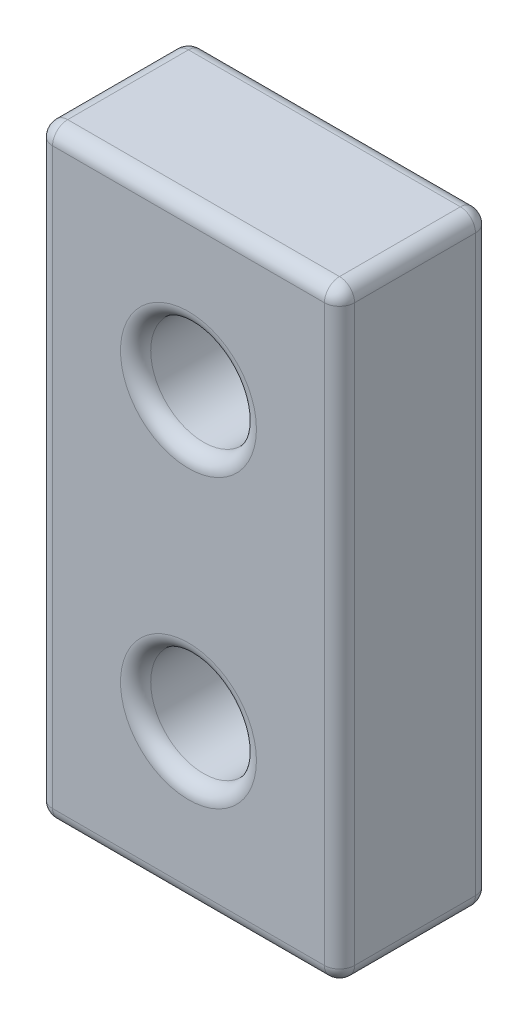
ISO-10303-21;
HEADER;
FILE_DESCRIPTION(('STEP AP214'),'2;1');
FILE_NAME('part.step','',(''),(''),'','','');
FILE_SCHEMA(('AUTOMOTIVE_DESIGN { 1 0 10303 214 1 1 1 1 }'));
ENDSEC;
DATA;
#1=APPLICATION_CONTEXT('core data for automotive mechanical design processes');
#2=APPLICATION_PROTOCOL_DEFINITION('international standard','automotive_design',2000,#1);
#3=PRODUCT_CONTEXT('',#1,'mechanical');
#4=PRODUCT('Part','Part','',(#3));
#5=PRODUCT_RELATED_PRODUCT_CATEGORY('part','',(#4));
#6=PRODUCT_DEFINITION_FORMATION('','',#4);
#7=PRODUCT_DEFINITION_CONTEXT('part definition',#1,'design');
#8=PRODUCT_DEFINITION('design','',#6,#7);
#9=PRODUCT_DEFINITION_SHAPE('','',#8);
#10=(LENGTH_UNIT() NAMED_UNIT(*) SI_UNIT(.MILLI.,.METRE.));
#11=(NAMED_UNIT(*) PLANE_ANGLE_UNIT() SI_UNIT($,.RADIAN.));
#12=(NAMED_UNIT(*) SI_UNIT($,.STERADIAN.) SOLID_ANGLE_UNIT());
#13=UNCERTAINTY_MEASURE_WITH_UNIT(LENGTH_MEASURE(1.E-05),#10,'distance_accuracy_value','');
#14=(GEOMETRIC_REPRESENTATION_CONTEXT(3) GLOBAL_UNCERTAINTY_ASSIGNED_CONTEXT((#13)) GLOBAL_UNIT_ASSIGNED_CONTEXT((#10,
#11,#12)) REPRESENTATION_CONTEXT('',''));
#15=CARTESIAN_POINT('',(0.,0.,0.));
#16=DIRECTION('',(0.,0.,1.));
#17=DIRECTION('',(1.,0.,0.));
#18=AXIS2_PLACEMENT_3D('',#15,#16,#17);
#19=CARTESIAN_POINT('',(9.,-19.,10.));
#20=DIRECTION('',(0.,0.,-1.));
#21=DIRECTION('',(-1.,0.,0.));
#22=AXIS2_PLACEMENT_3D('',#19,#20,#21);
#23=CYLINDRICAL_SURFACE('',#22,1.);
#24=DIRECTION('',(0.,0.,-1.));
#25=VECTOR('',#24,1.);
#26=CARTESIAN_POINT('',(10.,-19.,10.));
#27=LINE('',#26,#25);
#28=CARTESIAN_POINT('',(10.,-19.,9.));
#29=VERTEX_POINT('',#28);
#30=CARTESIAN_POINT('',(10.,-19.,0.999999999999999));
#31=VERTEX_POINT('',#30);
#32=EDGE_CURVE('E298',#29,#31,#27,.T.);
#33=ORIENTED_EDGE('',*,*,#32,.F.);
#34=CARTESIAN_POINT('',(9.,-19.,9.));
#35=DIRECTION('',(0.,0.,-1.));
#36=DIRECTION('',(-1.,0.,0.));
#37=AXIS2_PLACEMENT_3D('',#34,#35,#36);
#38=CIRCLE('',#37,1.);
#39=CARTESIAN_POINT('',(8.99999999999999,-20.,9.));
#40=VERTEX_POINT('',#39);
#41=EDGE_CURVE('E142',#29,#40,#38,.T.);
#42=ORIENTED_EDGE('',*,*,#41,.T.);
#43=DIRECTION('',(0.,0.,-1.));
#44=VECTOR('',#43,1.);
#45=CARTESIAN_POINT('',(8.99999999999999,-20.,10.));
#46=LINE('',#45,#44);
#47=CARTESIAN_POINT('',(8.99999999999999,-20.,0.999999999999999));
#48=VERTEX_POINT('',#47);
#49=EDGE_CURVE('E270',#40,#48,#46,.T.);
#50=ORIENTED_EDGE('',*,*,#49,.T.);
#51=CARTESIAN_POINT('',(9.,-19.,0.999999999999999));
#52=DIRECTION('',(0.,0.,-1.));
#53=DIRECTION('',(-1.,0.,0.));
#54=AXIS2_PLACEMENT_3D('',#51,#52,#53);
#55=CIRCLE('',#54,1.);
#56=EDGE_CURVE('E194',#48,#31,#55,.F.);
#57=ORIENTED_EDGE('',*,*,#56,.T.);
#58=EDGE_LOOP('',(#33,#42,#50,#57));
#59=FACE_BOUND('',#58,.T.);
#60=ADVANCED_FACE('F35',(#59),#23,.T.);
#61=CARTESIAN_POINT('',(10.,-19.,10.));
#62=DIRECTION('',(-1.,0.,0.));
#63=DIRECTION('',(0.,0.,1.));
#64=AXIS2_PLACEMENT_3D('',#61,#62,#63);
#65=PLANE('',#64);
#66=DIRECTION('',(0.,0.,-1.));
#67=VECTOR('',#66,1.);
#68=CARTESIAN_POINT('',(10.,19.,10.));
#69=LINE('',#68,#67);
#70=CARTESIAN_POINT('',(10.,19.,9.));
#71=VERTEX_POINT('',#70);
#72=CARTESIAN_POINT('',(10.,19.,0.999999999999999));
#73=VERTEX_POINT('',#72);
#74=EDGE_CURVE('E295',#71,#73,#69,.T.);
#75=ORIENTED_EDGE('',*,*,#74,.F.);
#76=DIRECTION('',(0.,1.,0.));
#77=VECTOR('',#76,1.);
#78=CARTESIAN_POINT('',(10.,-19.,9.));
#79=LINE('',#78,#77);
#80=EDGE_CURVE('E192',#71,#29,#79,.F.);
#81=ORIENTED_EDGE('',*,*,#80,.T.);
#82=ORIENTED_EDGE('',*,*,#32,.T.);
#83=DIRECTION('',(0.,1.,0.));
#84=VECTOR('',#83,1.);
#85=CARTESIAN_POINT('',(10.,-19.,0.999999999999999));
#86=LINE('',#85,#84);
#87=EDGE_CURVE('E189',#31,#73,#86,.T.);
#88=ORIENTED_EDGE('',*,*,#87,.T.);
#89=EDGE_LOOP('',(#75,#81,#82,#88));
#90=FACE_BOUND('',#89,.T.);
#91=ADVANCED_FACE('F344',(#90),#65,.F.);
#92=CARTESIAN_POINT('',(9.,19.,10.));
#93=DIRECTION('',(0.,0.,-1.));
#94=DIRECTION('',(-1.,0.,0.));
#95=AXIS2_PLACEMENT_3D('',#92,#93,#94);
#96=CYLINDRICAL_SURFACE('',#95,1.);
#97=DIRECTION('',(0.,0.,-1.));
#98=VECTOR('',#97,1.);
#99=CARTESIAN_POINT('',(8.99999999999999,20.,10.));
#100=LINE('',#99,#98);
#101=CARTESIAN_POINT('',(8.99999999999999,20.,9.));
#102=VERTEX_POINT('',#101);
#103=CARTESIAN_POINT('',(8.99999999999999,20.,0.999999999999999));
#104=VERTEX_POINT('',#103);
#105=EDGE_CURVE('E292',#102,#104,#100,.T.);
#106=ORIENTED_EDGE('',*,*,#105,.F.);
#107=CARTESIAN_POINT('',(9.,19.,9.));
#108=DIRECTION('',(0.,0.,-1.));
#109=DIRECTION('',(-1.,0.,0.));
#110=AXIS2_PLACEMENT_3D('',#107,#108,#109);
#111=CIRCLE('',#110,1.);
#112=EDGE_CURVE('E187',#102,#71,#111,.T.);
#113=ORIENTED_EDGE('',*,*,#112,.T.);
#114=ORIENTED_EDGE('',*,*,#74,.T.);
#115=CARTESIAN_POINT('',(9.,19.,0.999999999999999));
#116=DIRECTION('',(0.,0.,-1.));
#117=DIRECTION('',(-1.,0.,0.));
#118=AXIS2_PLACEMENT_3D('',#115,#116,#117);
#119=CIRCLE('',#118,1.);
#120=EDGE_CURVE('E185',#73,#104,#119,.F.);
#121=ORIENTED_EDGE('',*,*,#120,.T.);
#122=EDGE_LOOP('',(#106,#113,#114,#121));
#123=FACE_BOUND('',#122,.T.);
#124=ADVANCED_FACE('F345',(#123),#96,.T.);
#125=CARTESIAN_POINT('',(-8.99999999999999,20.,10.));
#126=DIRECTION('',(0.,-1.,0.));
#127=DIRECTION('',(0.,0.,-1.));
#128=AXIS2_PLACEMENT_3D('',#125,#126,#127);
#129=PLANE('',#128);
#130=DIRECTION('',(0.,0.,-1.));
#131=VECTOR('',#130,1.);
#132=CARTESIAN_POINT('',(-8.99999999999999,20.,10.));
#133=LINE('',#132,#131);
#134=CARTESIAN_POINT('',(-8.99999999999999,20.,9.));
#135=VERTEX_POINT('',#134);
#136=CARTESIAN_POINT('',(-8.99999999999999,20.,0.999999999999999));
#137=VERTEX_POINT('',#136);
#138=EDGE_CURVE('E289',#135,#137,#133,.T.);
#139=ORIENTED_EDGE('',*,*,#138,.F.);
#140=DIRECTION('',(-1.,0.,0.));
#141=VECTOR('',#140,1.);
#142=CARTESIAN_POINT('',(8.99999999999999,20.,9.));
#143=LINE('',#142,#141);
#144=EDGE_CURVE('E183',#135,#102,#143,.F.);
#145=ORIENTED_EDGE('',*,*,#144,.T.);
#146=ORIENTED_EDGE('',*,*,#105,.T.);
#147=DIRECTION('',(-1.,0.,0.));
#148=VECTOR('',#147,1.);
#149=CARTESIAN_POINT('',(-8.99999999999999,20.,0.999999999999999));
#150=LINE('',#149,#148);
#151=EDGE_CURVE('E181',#104,#137,#150,.T.);
#152=ORIENTED_EDGE('',*,*,#151,.T.);
#153=EDGE_LOOP('',(#139,#145,#146,#152));
#154=FACE_BOUND('',#153,.T.);
#155=ADVANCED_FACE('F602',(#154),#129,.F.);
#156=CARTESIAN_POINT('',(-9.,19.,10.));
#157=DIRECTION('',(0.,0.,-1.));
#158=DIRECTION('',(-1.,0.,0.));
#159=AXIS2_PLACEMENT_3D('',#156,#157,#158);
#160=CYLINDRICAL_SURFACE('',#159,1.);
#161=DIRECTION('',(0.,0.,-1.));
#162=VECTOR('',#161,1.);
#163=CARTESIAN_POINT('',(-10.,19.,10.));
#164=LINE('',#163,#162);
#165=CARTESIAN_POINT('',(-10.,19.,9.));
#166=VERTEX_POINT('',#165);
#167=CARTESIAN_POINT('',(-10.,19.,0.999999999999999));
#168=VERTEX_POINT('',#167);
#169=EDGE_CURVE('E286',#166,#168,#164,.T.);
#170=ORIENTED_EDGE('',*,*,#169,.F.);
#171=CARTESIAN_POINT('',(-9.,19.,9.));
#172=DIRECTION('',(0.,0.,-1.));
#173=DIRECTION('',(-1.,0.,0.));
#174=AXIS2_PLACEMENT_3D('',#171,#172,#173);
#175=CIRCLE('',#174,1.);
#176=EDGE_CURVE('E179',#166,#135,#175,.T.);
#177=ORIENTED_EDGE('',*,*,#176,.T.);
#178=ORIENTED_EDGE('',*,*,#138,.T.);
#179=CARTESIAN_POINT('',(-9.,19.,0.999999999999999));
#180=DIRECTION('',(0.,0.,-1.));
#181=DIRECTION('',(-1.,0.,0.));
#182=AXIS2_PLACEMENT_3D('',#179,#180,#181);
#183=CIRCLE('',#182,1.);
#184=EDGE_CURVE('E177',#137,#168,#183,.F.);
#185=ORIENTED_EDGE('',*,*,#184,.T.);
#186=EDGE_LOOP('',(#170,#177,#178,#185));
#187=FACE_BOUND('',#186,.T.);
#188=ADVANCED_FACE('F594',(#187),#160,.T.);
#189=CARTESIAN_POINT('',(-10.,-19.,10.));
#190=DIRECTION('',(1.,0.,0.));
#191=DIRECTION('',(0.,0.,-1.));
#192=AXIS2_PLACEMENT_3D('',#189,#190,#191);
#193=PLANE('',#192);
#194=DIRECTION('',(0.,0.,-1.));
#195=VECTOR('',#194,1.);
#196=CARTESIAN_POINT('',(-10.,-19.,10.));
#197=LINE('',#196,#195);
#198=CARTESIAN_POINT('',(-10.,-19.,9.));
#199=VERTEX_POINT('',#198);
#200=CARTESIAN_POINT('',(-10.,-19.,0.999999999999999));
#201=VERTEX_POINT('',#200);
#202=EDGE_CURVE('E278',#199,#201,#197,.T.);
#203=ORIENTED_EDGE('',*,*,#202,.F.);
#204=DIRECTION('',(0.,-1.,0.));
#205=VECTOR('',#204,1.);
#206=CARTESIAN_POINT('',(-10.,19.,9.));
#207=LINE('',#206,#205);
#208=EDGE_CURVE('E175',#199,#166,#207,.F.);
#209=ORIENTED_EDGE('',*,*,#208,.T.);
#210=ORIENTED_EDGE('',*,*,#169,.T.);
#211=DIRECTION('',(0.,-1.,0.));
#212=VECTOR('',#211,1.);
#213=CARTESIAN_POINT('',(-10.,-19.,0.999999999999999));
#214=LINE('',#213,#212);
#215=EDGE_CURVE('E173',#168,#201,#214,.T.);
#216=ORIENTED_EDGE('',*,*,#215,.T.);
#217=EDGE_LOOP('',(#203,#209,#210,#216));
#218=FACE_BOUND('',#217,.T.);
#219=ADVANCED_FACE('F324',(#218),#193,.F.);
#220=CARTESIAN_POINT('',(-9.,-19.,10.));
#221=DIRECTION('',(0.,0.,-1.));
#222=DIRECTION('',(-1.,0.,0.));
#223=AXIS2_PLACEMENT_3D('',#220,#221,#222);
#224=CYLINDRICAL_SURFACE('',#223,1.);
#225=DIRECTION('',(0.,0.,-1.));
#226=VECTOR('',#225,1.);
#227=CARTESIAN_POINT('',(-8.99999999999999,-20.,10.));
#228=LINE('',#227,#226);
#229=CARTESIAN_POINT('',(-8.99999999999999,-20.,9.));
#230=VERTEX_POINT('',#229);
#231=CARTESIAN_POINT('',(-8.99999999999999,-20.,0.999999999999999));
#232=VERTEX_POINT('',#231);
#233=EDGE_CURVE('E272',#230,#232,#228,.T.);
#234=ORIENTED_EDGE('',*,*,#233,.F.);
#235=CARTESIAN_POINT('',(-9.,-19.,9.));
#236=DIRECTION('',(0.,0.,-1.));
#237=DIRECTION('',(-1.,0.,0.));
#238=AXIS2_PLACEMENT_3D('',#235,#236,#237);
#239=CIRCLE('',#238,1.);
#240=EDGE_CURVE('E171',#230,#199,#239,.T.);
#241=ORIENTED_EDGE('',*,*,#240,.T.);
#242=ORIENTED_EDGE('',*,*,#202,.T.);
#243=CARTESIAN_POINT('',(-9.,-19.,0.999999999999999));
#244=DIRECTION('',(0.,0.,-1.));
#245=DIRECTION('',(-1.,0.,0.));
#246=AXIS2_PLACEMENT_3D('',#243,#244,#245);
#247=CIRCLE('',#246,1.);
#248=EDGE_CURVE('E169',#201,#232,#247,.F.);
#249=ORIENTED_EDGE('',*,*,#248,.T.);
#250=EDGE_LOOP('',(#234,#241,#242,#249));
#251=FACE_BOUND('',#250,.T.);
#252=ADVANCED_FACE('F322',(#251),#224,.T.);
#253=CARTESIAN_POINT('',(-8.99999999999999,-20.,10.));
#254=DIRECTION('',(0.,1.,0.));
#255=DIRECTION('',(0.,0.,1.));
#256=AXIS2_PLACEMENT_3D('',#253,#254,#255);
#257=PLANE('',#256);
#258=ORIENTED_EDGE('',*,*,#49,.F.);
#259=DIRECTION('',(1.,0.,0.));
#260=VECTOR('',#259,1.);
#261=CARTESIAN_POINT('',(-8.99999999999999,-20.,9.));
#262=LINE('',#261,#260);
#263=EDGE_CURVE('E133',#40,#230,#262,.F.);
#264=ORIENTED_EDGE('',*,*,#263,.T.);
#265=ORIENTED_EDGE('',*,*,#233,.T.);
#266=DIRECTION('',(1.,0.,0.));
#267=VECTOR('',#266,1.);
#268=CARTESIAN_POINT('',(-8.99999999999999,-20.,0.999999999999999));
#269=LINE('',#268,#267);
#270=EDGE_CURVE('E162',#232,#48,#269,.T.);
#271=ORIENTED_EDGE('',*,*,#270,.T.);
#272=EDGE_LOOP('',(#258,#264,#265,#271));
#273=FACE_BOUND('',#272,.T.);
#274=ADVANCED_FACE('F269',(#273),#257,.F.);
#275=CARTESIAN_POINT('',(9.,-19.,10.));
#276=DIRECTION('',(0.,0.,1.));
#277=DIRECTION('',(1.,0.,0.));
#278=AXIS2_PLACEMENT_3D('',#275,#276,#277);
#279=PLANE('',#278);
#280=DIRECTION('',(0.,-1.,0.));
#281=VECTOR('',#280,1.);
#282=CARTESIAN_POINT('',(-9.,-19.,10.));
#283=LINE('',#282,#281);
#284=CARTESIAN_POINT('',(-9.,19.,10.));
#285=VERTEX_POINT('',#284);
#286=CARTESIAN_POINT('',(-9.,-19.,10.));
#287=VERTEX_POINT('',#286);
#288=EDGE_CURVE('E160',#285,#287,#283,.T.);
#289=ORIENTED_EDGE('',*,*,#288,.T.);
#290=DIRECTION('',(1.,0.,0.));
#291=VECTOR('',#290,1.);
#292=CARTESIAN_POINT('',(8.99999999999999,-19.,10.));
#293=LINE('',#292,#291);
#294=CARTESIAN_POINT('',(9.,-19.,10.));
#295=VERTEX_POINT('',#294);
#296=EDGE_CURVE('E131',#287,#295,#293,.T.);
#297=ORIENTED_EDGE('',*,*,#296,.T.);
#298=DIRECTION('',(0.,1.,0.));
#299=VECTOR('',#298,1.);
#300=CARTESIAN_POINT('',(9.,19.,10.));
#301=LINE('',#300,#299);
#302=CARTESIAN_POINT('',(9.,19.,10.));
#303=VERTEX_POINT('',#302);
#304=EDGE_CURVE('E148',#295,#303,#301,.T.);
#305=ORIENTED_EDGE('',*,*,#304,.T.);
#306=DIRECTION('',(-1.,0.,0.));
#307=VECTOR('',#306,1.);
#308=CARTESIAN_POINT('',(-8.99999999999999,19.,10.));
#309=LINE('',#308,#307);
#310=EDGE_CURVE('E154',#303,#285,#309,.T.);
#311=ORIENTED_EDGE('',*,*,#310,.T.);
#312=EDGE_LOOP('',(#289,#297,#305,#311));
#313=FACE_BOUND('',#312,.T.);
#314=CARTESIAN_POINT('',(0.,-9.5,10.));
#315=DIRECTION('',(0.,0.,1.));
#316=DIRECTION('',(1.,0.,0.));
#317=AXIS2_PLACEMENT_3D('',#314,#315,#316);
#318=CIRCLE('',#317,4.5);
#319=CARTESIAN_POINT('',(4.5,-9.5,10.));
#320=VERTEX_POINT('',#319);
#321=EDGE_CURVE('E155',#320,#320,#318,.F.);
#322=ORIENTED_EDGE('',*,*,#321,.T.);
#323=EDGE_LOOP('',(#322));
#324=FACE_BOUND('',#323,.T.);
#325=CARTESIAN_POINT('',(0.,9.5,10.));
#326=DIRECTION('',(0.,0.,1.));
#327=DIRECTION('',(1.,0.,0.));
#328=AXIS2_PLACEMENT_3D('',#325,#326,#327);
#329=CIRCLE('',#328,4.5);
#330=CARTESIAN_POINT('',(4.49999999999999,9.5,10.));
#331=VERTEX_POINT('',#330);
#332=EDGE_CURVE('E300',#331,#331,#329,.F.);
#333=ORIENTED_EDGE('',*,*,#332,.T.);
#334=EDGE_LOOP('',(#333));
#335=FACE_BOUND('',#334,.T.);
#336=ADVANCED_FACE('F157',(#313,#324,#335),#279,.T.);
#337=CARTESIAN_POINT('',(9.,-19.,0.));
#338=DIRECTION('',(0.,0.,1.));
#339=DIRECTION('',(1.,0.,0.));
#340=AXIS2_PLACEMENT_3D('',#337,#338,#339);
#341=PLANE('',#340);
#342=DIRECTION('',(-1.,0.,0.));
#343=VECTOR('',#342,1.);
#344=CARTESIAN_POINT('',(9.,19.,0.));
#345=LINE('',#344,#343);
#346=CARTESIAN_POINT('',(-9.,19.,0.));
#347=VERTEX_POINT('',#346);
#348=CARTESIAN_POINT('',(9.,19.,0.));
#349=VERTEX_POINT('',#348);
#350=EDGE_CURVE('E52',#347,#349,#345,.F.);
#351=ORIENTED_EDGE('',*,*,#350,.T.);
#352=DIRECTION('',(0.,1.,0.));
#353=VECTOR('',#352,1.);
#354=CARTESIAN_POINT('',(9.,-19.,0.));
#355=LINE('',#354,#353);
#356=CARTESIAN_POINT('',(8.99999999999999,-19.,0.));
#357=VERTEX_POINT('',#356);
#358=EDGE_CURVE('E213',#349,#357,#355,.F.);
#359=ORIENTED_EDGE('',*,*,#358,.T.);
#360=DIRECTION('',(1.,0.,0.));
#361=VECTOR('',#360,1.);
#362=CARTESIAN_POINT('',(9.,-19.,0.));
#363=LINE('',#362,#361);
#364=CARTESIAN_POINT('',(-9.,-19.,0.));
#365=VERTEX_POINT('',#364);
#366=EDGE_CURVE('E209',#357,#365,#363,.F.);
#367=ORIENTED_EDGE('',*,*,#366,.T.);
#368=DIRECTION('',(0.,-1.,0.));
#369=VECTOR('',#368,1.);
#370=CARTESIAN_POINT('',(-9.,-19.,0.));
#371=LINE('',#370,#369);
#372=EDGE_CURVE('E57',#365,#347,#371,.F.);
#373=ORIENTED_EDGE('',*,*,#372,.T.);
#374=EDGE_LOOP('',(#351,#359,#367,#373));
#375=FACE_BOUND('',#374,.T.);
#376=CARTESIAN_POINT('',(0.,-9.5,0.));
#377=DIRECTION('',(0.,0.,1.));
#378=DIRECTION('',(1.,0.,0.));
#379=AXIS2_PLACEMENT_3D('',#376,#377,#378);
#380=CIRCLE('',#379,4.4392135623731);
#381=CARTESIAN_POINT('',(4.4392135623731,-9.5,0.));
#382=VERTEX_POINT('',#381);
#383=EDGE_CURVE('E206',#382,#382,#380,.T.);
#384=ORIENTED_EDGE('',*,*,#383,.T.);
#385=EDGE_LOOP('',(#384));
#386=FACE_BOUND('',#385,.T.);
#387=CARTESIAN_POINT('',(0.,9.5,0.));
#388=DIRECTION('',(0.,0.,1.));
#389=DIRECTION('',(1.,0.,0.));
#390=AXIS2_PLACEMENT_3D('',#387,#388,#389);
#391=CIRCLE('',#390,4.4392135623731);
#392=CARTESIAN_POINT('',(4.43921356237309,9.5,0.));
#393=VERTEX_POINT('',#392);
#394=EDGE_CURVE('E203',#393,#393,#391,.T.);
#395=ORIENTED_EDGE('',*,*,#394,.T.);
#396=EDGE_LOOP('',(#395));
#397=FACE_BOUND('',#396,.T.);
#398=ADVANCED_FACE('F556',(#375,#386,#397),#341,.F.);
#399=CARTESIAN_POINT('',(0.,-9.5,0.));
#400=DIRECTION('',(0.,0.,-1.));
#401=DIRECTION('',(-1.,0.,0.));
#402=AXIS2_PLACEMENT_3D('',#399,#400,#401);
#403=CYLINDRICAL_SURFACE('',#402,3.5);
#404=CARTESIAN_POINT('',(0.,-9.5,9.));
#405=DIRECTION('',(0.,0.,1.));
#406=DIRECTION('',(1.,0.,0.));
#407=AXIS2_PLACEMENT_3D('',#404,#405,#406);
#408=CIRCLE('',#407,3.5);
#409=CARTESIAN_POINT('',(3.5,-9.5,9.));
#410=VERTEX_POINT('',#409);
#411=EDGE_CURVE('E197',#410,#410,#408,.T.);
#412=ORIENTED_EDGE('',*,*,#411,.T.);
#413=EDGE_LOOP('',(#412));
#414=FACE_BOUND('',#413,.T.);
#415=CARTESIAN_POINT('',(0.,-9.5,0.525000000000001));
#416=DIRECTION('',(0.,0.,-1.));
#417=DIRECTION('',(-1.,0.,0.));
#418=AXIS2_PLACEMENT_3D('',#415,#416,#417);
#419=CIRCLE('',#418,3.5);
#420=CARTESIAN_POINT('',(-3.5,-9.5,0.525000000000001));
#421=VERTEX_POINT('',#420);
#422=EDGE_CURVE('E276',#421,#421,#419,.T.);
#423=ORIENTED_EDGE('',*,*,#422,.T.);
#424=EDGE_LOOP('',(#423));
#425=FACE_BOUND('',#424,.T.);
#426=ADVANCED_FACE('F547',(#414,#425),#403,.F.);
#427=CARTESIAN_POINT('',(0.,-9.5,0.));
#428=DIRECTION('',(0.,0.,-1.));
#429=DIRECTION('',(-1.,0.,0.));
#430=AXIS2_PLACEMENT_3D('',#427,#428,#429);
#431=CONICAL_SURFACE('',#430,4.025,0.78539816339745);
#432=CARTESIAN_POINT('',(0.,-9.5,0.292893218813452));
#433=DIRECTION('',(0.,0.,1.));
#434=DIRECTION('',(1.,0.,0.));
#435=AXIS2_PLACEMENT_3D('',#432,#433,#434);
#436=CIRCLE('',#435,3.73210678118655);
#437=CARTESIAN_POINT('',(3.73210678118655,-9.5,0.292893218813452));
#438=VERTEX_POINT('',#437);
#439=EDGE_CURVE('E44',#438,#438,#436,.F.);
#440=ORIENTED_EDGE('',*,*,#439,.T.);
#441=EDGE_LOOP('',(#440));
#442=FACE_BOUND('',#441,.T.);
#443=ORIENTED_EDGE('',*,*,#422,.F.);
#444=EDGE_LOOP('',(#443));
#445=FACE_BOUND('',#444,.T.);
#446=ADVANCED_FACE('F537',(#442,#445),#431,.F.);
#447=CARTESIAN_POINT('',(0.,9.5,0.));
#448=DIRECTION('',(0.,0.,-1.));
#449=DIRECTION('',(-1.,0.,0.));
#450=AXIS2_PLACEMENT_3D('',#447,#448,#449);
#451=CYLINDRICAL_SURFACE('',#450,3.5);
#452=CARTESIAN_POINT('',(0.,9.5,9.));
#453=DIRECTION('',(0.,0.,1.));
#454=DIRECTION('',(1.,0.,0.));
#455=AXIS2_PLACEMENT_3D('',#452,#453,#454);
#456=CIRCLE('',#455,3.5);
#457=CARTESIAN_POINT('',(3.49999999999999,9.5,9.));
#458=VERTEX_POINT('',#457);
#459=EDGE_CURVE('E200',#458,#458,#456,.T.);
#460=ORIENTED_EDGE('',*,*,#459,.T.);
#461=EDGE_LOOP('',(#460));
#462=FACE_BOUND('',#461,.T.);
#463=CARTESIAN_POINT('',(0.,9.5,0.525000000000001));
#464=DIRECTION('',(0.,0.,-1.));
#465=DIRECTION('',(-1.,0.,0.));
#466=AXIS2_PLACEMENT_3D('',#463,#464,#465);
#467=CIRCLE('',#466,3.5);
#468=CARTESIAN_POINT('',(-3.5,9.5,0.525000000000001));
#469=VERTEX_POINT('',#468);
#470=EDGE_CURVE('E230',#469,#469,#467,.T.);
#471=ORIENTED_EDGE('',*,*,#470,.T.);
#472=EDGE_LOOP('',(#471));
#473=FACE_BOUND('',#472,.T.);
#474=ADVANCED_FACE('F528',(#462,#473),#451,.F.);
#475=CARTESIAN_POINT('',(0.,9.5,0.));
#476=DIRECTION('',(0.,0.,-1.));
#477=DIRECTION('',(-1.,0.,0.));
#478=AXIS2_PLACEMENT_3D('',#475,#476,#477);
#479=CONICAL_SURFACE('',#478,4.025,0.78539816339745);
#480=CARTESIAN_POINT('',(0.,9.5,0.292893218813452));
#481=DIRECTION('',(0.,0.,1.));
#482=DIRECTION('',(1.,0.,0.));
#483=AXIS2_PLACEMENT_3D('',#480,#481,#482);
#484=CIRCLE('',#483,3.73210678118655);
#485=CARTESIAN_POINT('',(3.73210678118654,9.5,0.292893218813452));
#486=VERTEX_POINT('',#485);
#487=EDGE_CURVE('E11',#486,#486,#484,.F.);
#488=ORIENTED_EDGE('',*,*,#487,.T.);
#489=EDGE_LOOP('',(#488));
#490=FACE_BOUND('',#489,.T.);
#491=ORIENTED_EDGE('',*,*,#470,.F.);
#492=EDGE_LOOP('',(#491));
#493=FACE_BOUND('',#492,.T.);
#494=ADVANCED_FACE('F520',(#490,#493),#479,.F.);
#495=CARTESIAN_POINT('',(9.,19.,9.));
#496=DIRECTION('',(1.,0.,0.));
#497=DIRECTION('',(0.,0.,-1.));
#498=AXIS2_PLACEMENT_3D('',#495,#496,#497);
#499=CYLINDRICAL_SURFACE('',#498,1.);
#500=CARTESIAN_POINT('',(8.99999999999999,19.,9.));
#501=DIRECTION('',(1.,0.,0.));
#502=DIRECTION('',(0.,0.,-1.));
#503=AXIS2_PLACEMENT_3D('',#500,#501,#502);
#504=CIRCLE('',#503,1.);
#505=EDGE_CURVE('E224',#102,#303,#504,.T.);
#506=ORIENTED_EDGE('',*,*,#505,.F.);
#507=ORIENTED_EDGE('',*,*,#144,.F.);
#508=CARTESIAN_POINT('',(-9.,19.,9.));
#509=DIRECTION('',(-1.,0.,0.));
#510=DIRECTION('',(0.,-1.,0.));
#511=AXIS2_PLACEMENT_3D('',#508,#509,#510);
#512=CIRCLE('',#511,1.);
#513=EDGE_CURVE('E227',#285,#135,#512,.T.);
#514=ORIENTED_EDGE('',*,*,#513,.F.);
#515=ORIENTED_EDGE('',*,*,#310,.F.);
#516=EDGE_LOOP('',(#506,#507,#514,#515));
#517=FACE_BOUND('',#516,.T.);
#518=ADVANCED_FACE('F309',(#517),#499,.T.);
#519=CARTESIAN_POINT('',(-9.,19.,9.));
#520=DIRECTION('',(0.,0.,1.));
#521=DIRECTION('',(1.,0.,0.));
#522=AXIS2_PLACEMENT_3D('',#519,#520,#521);
#523=SPHERICAL_SURFACE('',#522,1.);
#524=ORIENTED_EDGE('',*,*,#513,.T.);
#525=ORIENTED_EDGE('',*,*,#176,.F.);
#526=CARTESIAN_POINT('',(-9.,19.,9.));
#527=DIRECTION('',(0.,-1.,0.));
#528=DIRECTION('',(1.,0.,0.));
#529=AXIS2_PLACEMENT_3D('',#526,#527,#528);
#530=CIRCLE('',#529,1.);
#531=EDGE_CURVE('E221',#285,#166,#530,.T.);
#532=ORIENTED_EDGE('',*,*,#531,.F.);
#533=EDGE_LOOP('',(#524,#525,#532));
#534=FACE_BOUND('',#533,.T.);
#535=ADVANCED_FACE('F312',(#534),#523,.T.);
#536=CARTESIAN_POINT('',(9.,19.,9.));
#537=DIRECTION('',(0.,0.,1.));
#538=DIRECTION('',(1.,0.,0.));
#539=AXIS2_PLACEMENT_3D('',#536,#537,#538);
#540=SPHERICAL_SURFACE('',#539,1.);
#541=ORIENTED_EDGE('',*,*,#112,.F.);
#542=ORIENTED_EDGE('',*,*,#505,.T.);
#543=CARTESIAN_POINT('',(9.,19.,9.));
#544=DIRECTION('',(0.,-1.,0.));
#545=DIRECTION('',(1.,0.,0.));
#546=AXIS2_PLACEMENT_3D('',#543,#544,#545);
#547=CIRCLE('',#546,1.);
#548=EDGE_CURVE('E151',#71,#303,#547,.T.);
#549=ORIENTED_EDGE('',*,*,#548,.F.);
#550=EDGE_LOOP('',(#541,#542,#549));
#551=FACE_BOUND('',#550,.T.);
#552=ADVANCED_FACE('F348',(#551),#540,.T.);
#553=CARTESIAN_POINT('',(-9.,-19.,9.));
#554=DIRECTION('',(0.,1.,0.));
#555=DIRECTION('',(0.,0.,1.));
#556=AXIS2_PLACEMENT_3D('',#553,#554,#555);
#557=CYLINDRICAL_SURFACE('',#556,1.);
#558=ORIENTED_EDGE('',*,*,#531,.T.);
#559=ORIENTED_EDGE('',*,*,#208,.F.);
#560=CARTESIAN_POINT('',(-9.,-19.,9.));
#561=DIRECTION('',(0.,-1.,0.));
#562=DIRECTION('',(0.,0.,-1.));
#563=AXIS2_PLACEMENT_3D('',#560,#561,#562);
#564=CIRCLE('',#563,1.);
#565=EDGE_CURVE('E145',#287,#199,#564,.T.);
#566=ORIENTED_EDGE('',*,*,#565,.F.);
#567=ORIENTED_EDGE('',*,*,#288,.F.);
#568=EDGE_LOOP('',(#558,#559,#566,#567));
#569=FACE_BOUND('',#568,.T.);
#570=ADVANCED_FACE('F315',(#569),#557,.T.);
#571=CARTESIAN_POINT('',(9.,-19.,9.));
#572=DIRECTION('',(0.,-1.,0.));
#573=DIRECTION('',(0.,0.,-1.));
#574=AXIS2_PLACEMENT_3D('',#571,#572,#573);
#575=CYLINDRICAL_SURFACE('',#574,1.);
#576=ORIENTED_EDGE('',*,*,#548,.T.);
#577=ORIENTED_EDGE('',*,*,#304,.F.);
#578=CARTESIAN_POINT('',(9.,-19.,9.));
#579=DIRECTION('',(0.,-1.,0.));
#580=DIRECTION('',(0.,0.,-1.));
#581=AXIS2_PLACEMENT_3D('',#578,#579,#580);
#582=CIRCLE('',#581,1.);
#583=EDGE_CURVE('E139',#29,#295,#582,.T.);
#584=ORIENTED_EDGE('',*,*,#583,.F.);
#585=ORIENTED_EDGE('',*,*,#80,.F.);
#586=EDGE_LOOP('',(#576,#577,#584,#585));
#587=FACE_BOUND('',#586,.T.);
#588=ADVANCED_FACE('F149',(#587),#575,.T.);
#589=CARTESIAN_POINT('',(-9.,-19.,9.));
#590=DIRECTION('',(0.,0.,1.));
#591=DIRECTION('',(1.,0.,0.));
#592=AXIS2_PLACEMENT_3D('',#589,#590,#591);
#593=SPHERICAL_SURFACE('',#592,1.);
#594=ORIENTED_EDGE('',*,*,#565,.T.);
#595=ORIENTED_EDGE('',*,*,#240,.F.);
#596=CARTESIAN_POINT('',(-9.,-19.,9.));
#597=DIRECTION('',(1.,0.,0.));
#598=DIRECTION('',(0.,1.,0.));
#599=AXIS2_PLACEMENT_3D('',#596,#597,#598);
#600=CIRCLE('',#599,1.);
#601=EDGE_CURVE('E136',#287,#230,#600,.T.);
#602=ORIENTED_EDGE('',*,*,#601,.F.);
#603=EDGE_LOOP('',(#594,#595,#602));
#604=FACE_BOUND('',#603,.T.);
#605=ADVANCED_FACE('F319',(#604),#593,.T.);
#606=CARTESIAN_POINT('',(9.,-19.,9.));
#607=DIRECTION('',(0.,0.,1.));
#608=DIRECTION('',(1.,0.,0.));
#609=AXIS2_PLACEMENT_3D('',#606,#607,#608);
#610=SPHERICAL_SURFACE('',#609,1.);
#611=ORIENTED_EDGE('',*,*,#41,.F.);
#612=ORIENTED_EDGE('',*,*,#583,.T.);
#613=CARTESIAN_POINT('',(9.,-19.,9.));
#614=DIRECTION('',(-1.,0.,0.));
#615=DIRECTION('',(0.,-1.,0.));
#616=AXIS2_PLACEMENT_3D('',#613,#614,#615);
#617=CIRCLE('',#616,1.);
#618=EDGE_CURVE('E127',#40,#295,#617,.T.);
#619=ORIENTED_EDGE('',*,*,#618,.F.);
#620=EDGE_LOOP('',(#611,#612,#619));
#621=FACE_BOUND('',#620,.T.);
#622=ADVANCED_FACE('F141',(#621),#610,.T.);
#623=CARTESIAN_POINT('',(9.,-19.,9.));
#624=DIRECTION('',(-1.,0.,0.));
#625=DIRECTION('',(0.,0.,1.));
#626=AXIS2_PLACEMENT_3D('',#623,#624,#625);
#627=CYLINDRICAL_SURFACE('',#626,1.);
#628=ORIENTED_EDGE('',*,*,#601,.T.);
#629=ORIENTED_EDGE('',*,*,#263,.F.);
#630=ORIENTED_EDGE('',*,*,#618,.T.);
#631=ORIENTED_EDGE('',*,*,#296,.F.);
#632=EDGE_LOOP('',(#628,#629,#630,#631));
#633=FACE_BOUND('',#632,.T.);
#634=ADVANCED_FACE('F129',(#633),#627,.T.);
#635=CARTESIAN_POINT('',(0.,-9.5,9.));
#636=DIRECTION('',(0.,0.,1.));
#637=DIRECTION('',(1.,0.,0.));
#638=AXIS2_PLACEMENT_3D('',#635,#636,#637);
#639=TOROIDAL_SURFACE('',#638,4.5,1.);
#640=ORIENTED_EDGE('',*,*,#411,.F.);
#641=EDGE_LOOP('',(#640));
#642=FACE_BOUND('',#641,.T.);
#643=ORIENTED_EDGE('',*,*,#321,.F.);
#644=EDGE_LOOP('',(#643));
#645=FACE_BOUND('',#644,.T.);
#646=ADVANCED_FACE('F367',(#642,#645),#639,.T.);
#647=CARTESIAN_POINT('',(0.,9.5,9.));
#648=DIRECTION('',(0.,0.,1.));
#649=DIRECTION('',(1.,0.,0.));
#650=AXIS2_PLACEMENT_3D('',#647,#648,#649);
#651=TOROIDAL_SURFACE('',#650,4.5,1.);
#652=ORIENTED_EDGE('',*,*,#459,.F.);
#653=EDGE_LOOP('',(#652));
#654=FACE_BOUND('',#653,.T.);
#655=ORIENTED_EDGE('',*,*,#332,.F.);
#656=EDGE_LOOP('',(#655));
#657=FACE_BOUND('',#656,.T.);
#658=ADVANCED_FACE('F395',(#654,#657),#651,.T.);
#659=CARTESIAN_POINT('',(-9.,-19.,0.999999999999999));
#660=DIRECTION('',(0.,-1.,0.));
#661=DIRECTION('',(0.,0.,-1.));
#662=AXIS2_PLACEMENT_3D('',#659,#660,#661);
#663=CYLINDRICAL_SURFACE('',#662,1.);
#664=CARTESIAN_POINT('',(-9.,-19.,0.999999999999999));
#665=DIRECTION('',(0.,-1.,0.));
#666=DIRECTION('',(0.,0.,-1.));
#667=AXIS2_PLACEMENT_3D('',#664,#665,#666);
#668=CIRCLE('',#667,1.);
#669=EDGE_CURVE('E39',#201,#365,#668,.T.);
#670=ORIENTED_EDGE('',*,*,#669,.F.);
#671=ORIENTED_EDGE('',*,*,#215,.F.);
#672=CARTESIAN_POINT('',(-9.,19.,1.));
#673=DIRECTION('',(0.,1.,0.));
#674=DIRECTION('',(-1.,0.,0.));
#675=AXIS2_PLACEMENT_3D('',#672,#673,#674);
#676=CIRCLE('',#675,1.);
#677=EDGE_CURVE('E246',#347,#168,#676,.T.);
#678=ORIENTED_EDGE('',*,*,#677,.F.);
#679=ORIENTED_EDGE('',*,*,#372,.F.);
#680=EDGE_LOOP('',(#670,#671,#678,#679));
#681=FACE_BOUND('',#680,.T.);
#682=ADVANCED_FACE('F326',(#681),#663,.T.);
#683=CARTESIAN_POINT('',(-9.,-19.,0.999999999999999));
#684=DIRECTION('',(0.,0.,1.));
#685=DIRECTION('',(1.,0.,0.));
#686=AXIS2_PLACEMENT_3D('',#683,#684,#685);
#687=SPHERICAL_SURFACE('',#686,1.);
#688=ORIENTED_EDGE('',*,*,#248,.F.);
#689=ORIENTED_EDGE('',*,*,#669,.T.);
#690=CARTESIAN_POINT('',(-9.,-19.,0.999999999999999));
#691=DIRECTION('',(1.,0.,0.));
#692=DIRECTION('',(0.,1.,0.));
#693=AXIS2_PLACEMENT_3D('',#690,#691,#692);
#694=CIRCLE('',#693,1.);
#695=EDGE_CURVE('E244',#232,#365,#694,.T.);
#696=ORIENTED_EDGE('',*,*,#695,.F.);
#697=EDGE_LOOP('',(#688,#689,#696));
#698=FACE_BOUND('',#697,.T.);
#699=ADVANCED_FACE('F256',(#698),#687,.T.);
#700=CARTESIAN_POINT('',(-9.,19.,0.999999999999999));
#701=DIRECTION('',(0.,0.,1.));
#702=DIRECTION('',(1.,0.,0.));
#703=AXIS2_PLACEMENT_3D('',#700,#701,#702);
#704=SPHERICAL_SURFACE('',#703,1.);
#705=ORIENTED_EDGE('',*,*,#677,.T.);
#706=ORIENTED_EDGE('',*,*,#184,.F.);
#707=CARTESIAN_POINT('',(-9.,19.,1.));
#708=DIRECTION('',(1.,0.,0.));
#709=DIRECTION('',(0.,1.,0.));
#710=AXIS2_PLACEMENT_3D('',#707,#708,#709);
#711=CIRCLE('',#710,1.);
#712=EDGE_CURVE('E241',#347,#137,#711,.T.);
#713=ORIENTED_EDGE('',*,*,#712,.F.);
#714=EDGE_LOOP('',(#705,#706,#713));
#715=FACE_BOUND('',#714,.T.);
#716=ADVANCED_FACE('F327',(#715),#704,.T.);
#717=CARTESIAN_POINT('',(-8.99999999999999,-19.,0.999999999999999));
#718=DIRECTION('',(1.,0.,0.));
#719=DIRECTION('',(0.,0.,-1.));
#720=AXIS2_PLACEMENT_3D('',#717,#718,#719);
#721=CYLINDRICAL_SURFACE('',#720,1.);
#722=ORIENTED_EDGE('',*,*,#695,.T.);
#723=ORIENTED_EDGE('',*,*,#366,.F.);
#724=CARTESIAN_POINT('',(8.99999999999999,-19.,0.999999999999999));
#725=DIRECTION('',(1.,0.,0.));
#726=DIRECTION('',(0.,0.,-1.));
#727=AXIS2_PLACEMENT_3D('',#724,#725,#726);
#728=CIRCLE('',#727,1.);
#729=EDGE_CURVE('E238',#48,#357,#728,.T.);
#730=ORIENTED_EDGE('',*,*,#729,.F.);
#731=ORIENTED_EDGE('',*,*,#270,.F.);
#732=EDGE_LOOP('',(#722,#723,#730,#731));
#733=FACE_BOUND('',#732,.T.);
#734=ADVANCED_FACE('F262',(#733),#721,.T.);
#735=CARTESIAN_POINT('',(-8.99999999999999,19.,0.999999999999999));
#736=DIRECTION('',(-1.,0.,0.));
#737=DIRECTION('',(0.,0.,1.));
#738=AXIS2_PLACEMENT_3D('',#735,#736,#737);
#739=CYLINDRICAL_SURFACE('',#738,1.);
#740=ORIENTED_EDGE('',*,*,#712,.T.);
#741=ORIENTED_EDGE('',*,*,#151,.F.);
#742=CARTESIAN_POINT('',(9.,19.,1.));
#743=DIRECTION('',(1.,0.,0.));
#744=DIRECTION('',(0.,1.,0.));
#745=AXIS2_PLACEMENT_3D('',#742,#743,#744);
#746=CIRCLE('',#745,1.);
#747=EDGE_CURVE('E235',#349,#104,#746,.T.);
#748=ORIENTED_EDGE('',*,*,#747,.F.);
#749=ORIENTED_EDGE('',*,*,#350,.F.);
#750=EDGE_LOOP('',(#740,#741,#748,#749));
#751=FACE_BOUND('',#750,.T.);
#752=ADVANCED_FACE('F330',(#751),#739,.T.);
#753=CARTESIAN_POINT('',(9.,-19.,0.999999999999999));
#754=DIRECTION('',(0.,0.,1.));
#755=DIRECTION('',(1.,0.,0.));
#756=AXIS2_PLACEMENT_3D('',#753,#754,#755);
#757=SPHERICAL_SURFACE('',#756,1.);
#758=ORIENTED_EDGE('',*,*,#56,.F.);
#759=ORIENTED_EDGE('',*,*,#729,.T.);
#760=CARTESIAN_POINT('',(9.,-19.,0.999999999999999));
#761=DIRECTION('',(0.,1.,0.));
#762=DIRECTION('',(-1.,0.,0.));
#763=AXIS2_PLACEMENT_3D('',#760,#761,#762);
#764=CIRCLE('',#763,1.);
#765=EDGE_CURVE('E233',#31,#357,#764,.T.);
#766=ORIENTED_EDGE('',*,*,#765,.F.);
#767=EDGE_LOOP('',(#758,#759,#766));
#768=FACE_BOUND('',#767,.T.);
#769=ADVANCED_FACE('F434',(#768),#757,.T.);
#770=CARTESIAN_POINT('',(9.,19.,0.999999999999999));
#771=DIRECTION('',(0.,0.,1.));
#772=DIRECTION('',(1.,0.,0.));
#773=AXIS2_PLACEMENT_3D('',#770,#771,#772);
#774=SPHERICAL_SURFACE('',#773,1.);
#775=ORIENTED_EDGE('',*,*,#747,.T.);
#776=ORIENTED_EDGE('',*,*,#120,.F.);
#777=CARTESIAN_POINT('',(9.,19.,1.));
#778=DIRECTION('',(0.,-1.,0.));
#779=DIRECTION('',(1.,0.,0.));
#780=AXIS2_PLACEMENT_3D('',#777,#778,#779);
#781=CIRCLE('',#780,1.);
#782=EDGE_CURVE('E231',#349,#73,#781,.T.);
#783=ORIENTED_EDGE('',*,*,#782,.F.);
#784=EDGE_LOOP('',(#775,#776,#783));
#785=FACE_BOUND('',#784,.T.);
#786=ADVANCED_FACE('F339',(#785),#774,.T.);
#787=CARTESIAN_POINT('',(9.,-19.,0.999999999999999));
#788=DIRECTION('',(0.,1.,0.));
#789=DIRECTION('',(0.,0.,1.));
#790=AXIS2_PLACEMENT_3D('',#787,#788,#789);
#791=CYLINDRICAL_SURFACE('',#790,1.);
#792=ORIENTED_EDGE('',*,*,#765,.T.);
#793=ORIENTED_EDGE('',*,*,#358,.F.);
#794=ORIENTED_EDGE('',*,*,#782,.T.);
#795=ORIENTED_EDGE('',*,*,#87,.F.);
#796=EDGE_LOOP('',(#792,#793,#794,#795));
#797=FACE_BOUND('',#796,.T.);
#798=ADVANCED_FACE('F336',(#797),#791,.T.);
#799=CARTESIAN_POINT('',(0.,-9.5,1.));
#800=DIRECTION('',(0.,0.,1.));
#801=DIRECTION('',(1.,0.,0.));
#802=AXIS2_PLACEMENT_3D('',#799,#800,#801);
#803=TOROIDAL_SURFACE('',#802,4.4392135623731,1.);
#804=ORIENTED_EDGE('',*,*,#383,.F.);
#805=EDGE_LOOP('',(#804));
#806=FACE_BOUND('',#805,.T.);
#807=ORIENTED_EDGE('',*,*,#439,.F.);
#808=EDGE_LOOP('',(#807));
#809=FACE_BOUND('',#808,.T.);
#810=ADVANCED_FACE('F454',(#806,#809),#803,.T.);
#811=CARTESIAN_POINT('',(0.,9.5,1.));
#812=DIRECTION('',(0.,0.,1.));
#813=DIRECTION('',(1.,0.,0.));
#814=AXIS2_PLACEMENT_3D('',#811,#812,#813);
#815=TOROIDAL_SURFACE('',#814,4.4392135623731,1.);
#816=ORIENTED_EDGE('',*,*,#394,.F.);
#817=EDGE_LOOP('',(#816));
#818=FACE_BOUND('',#817,.T.);
#819=ORIENTED_EDGE('',*,*,#487,.F.);
#820=EDGE_LOOP('',(#819));
#821=FACE_BOUND('',#820,.T.);
#822=ADVANCED_FACE('F37',(#818,#821),#815,.T.);
#823=CLOSED_SHELL('',(#60,#91,#124,#155,#188,#219,#252,#274,#336,#398,#426,#446,#474,#494,#518,
#535,#552,#570,#588,#605,#622,#634,#646,#658,#682,#699,#716,#734,#752,#769,#786,#798,#810,#822));
#824=MANIFOLD_SOLID_BREP('B2',#823);
#825=ADVANCED_BREP_SHAPE_REPRESENTATION('',(#18,#824),#14);
#826=SHAPE_DEFINITION_REPRESENTATION(#9,#825);
ENDSEC;
END-ISO-10303-21;
